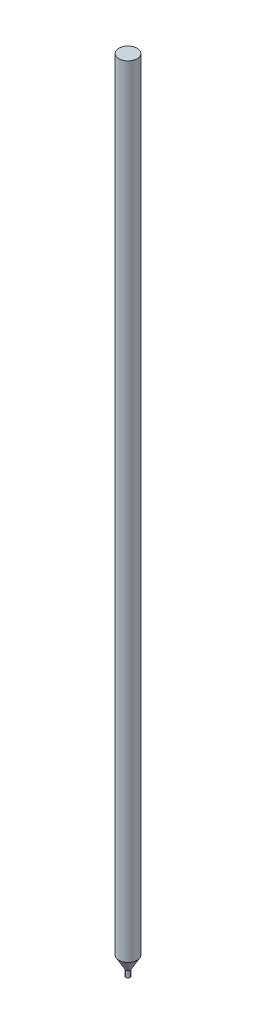
ISO-10303-21;
HEADER;
FILE_DESCRIPTION(('STEP AP214'),'2;1');
FILE_NAME('part.step','',(''),(''),'','','');
FILE_SCHEMA(('AUTOMOTIVE_DESIGN { 1 0 10303 214 1 1 1 1 }'));
ENDSEC;
DATA;
#1=APPLICATION_CONTEXT('core data for automotive mechanical design processes');
#2=APPLICATION_PROTOCOL_DEFINITION('international standard','automotive_design',2000,#1);
#3=PRODUCT_CONTEXT('',#1,'mechanical');
#4=PRODUCT('Part','Part','',(#3));
#5=PRODUCT_RELATED_PRODUCT_CATEGORY('part','',(#4));
#6=PRODUCT_DEFINITION_FORMATION('','',#4);
#7=PRODUCT_DEFINITION_CONTEXT('part definition',#1,'design');
#8=PRODUCT_DEFINITION('design','',#6,#7);
#9=PRODUCT_DEFINITION_SHAPE('','',#8);
#10=(LENGTH_UNIT() NAMED_UNIT(*) SI_UNIT(.MILLI.,.METRE.));
#11=(NAMED_UNIT(*) PLANE_ANGLE_UNIT() SI_UNIT($,.RADIAN.));
#12=(NAMED_UNIT(*) SI_UNIT($,.STERADIAN.) SOLID_ANGLE_UNIT());
#13=UNCERTAINTY_MEASURE_WITH_UNIT(LENGTH_MEASURE(1.E-05),#10,'distance_accuracy_value','');
#14=(GEOMETRIC_REPRESENTATION_CONTEXT(3) GLOBAL_UNCERTAINTY_ASSIGNED_CONTEXT((#13)) GLOBAL_UNIT_ASSIGNED_CONTEXT((#10,
#11,#12)) REPRESENTATION_CONTEXT('',''));
#15=CARTESIAN_POINT('',(0.,0.,0.));
#16=DIRECTION('',(0.,0.,1.));
#17=DIRECTION('',(1.,0.,0.));
#18=AXIS2_PLACEMENT_3D('',#15,#16,#17);
#19=CARTESIAN_POINT('',(0.,75.,0.));
#20=DIRECTION('',(0.,-1.,0.));
#21=DIRECTION('',(0.,0.,-1.));
#22=AXIS2_PLACEMENT_3D('',#19,#20,#21);
#23=CYLINDRICAL_SURFACE('',#22,0.875000000000001);
#24=CARTESIAN_POINT('',(0.,75.,0.));
#25=DIRECTION('',(0.,1.,0.));
#26=DIRECTION('',(0.,0.,1.));
#27=AXIS2_PLACEMENT_3D('',#24,#25,#26);
#28=CIRCLE('',#27,0.875000000000001);
#29=CARTESIAN_POINT('',(0.,75.,0.875000000000001));
#30=VERTEX_POINT('',#29);
#31=EDGE_CURVE('E10',#30,#30,#28,.T.);
#32=ORIENTED_EDGE('',*,*,#31,.F.);
#33=EDGE_LOOP('',(#32));
#34=FACE_BOUND('',#33,.T.);
#35=CARTESIAN_POINT('',(0.,0.,0.));
#36=DIRECTION('',(0.,1.,0.));
#37=DIRECTION('',(0.,0.,1.));
#38=AXIS2_PLACEMENT_3D('',#35,#36,#37);
#39=CIRCLE('',#38,0.875000000000001);
#40=CARTESIAN_POINT('',(0.,0.,0.875000000000001));
#41=VERTEX_POINT('',#40);
#42=EDGE_CURVE('E54',#41,#41,#39,.T.);
#43=ORIENTED_EDGE('',*,*,#42,.T.);
#44=EDGE_LOOP('',(#43));
#45=FACE_BOUND('',#44,.T.);
#46=ADVANCED_FACE('F36',(#34,#45),#23,.T.);
#47=CARTESIAN_POINT('',(0.,75.,0.));
#48=DIRECTION('',(0.,1.,0.));
#49=DIRECTION('',(0.,0.,1.));
#50=AXIS2_PLACEMENT_3D('',#47,#48,#49);
#51=PLANE('',#50);
#52=ORIENTED_EDGE('',*,*,#31,.T.);
#53=EDGE_LOOP('',(#52));
#54=FACE_BOUND('',#53,.T.);
#55=ADVANCED_FACE('F74',(#54),#51,.T.);
#56=CARTESIAN_POINT('',(0.,-1.76913429510898,0.));
#57=DIRECTION('',(0.,1.,0.));
#58=DIRECTION('',(0.,0.,1.));
#59=AXIS2_PLACEMENT_3D('',#56,#57,#58);
#60=PLANE('',#59);
#61=CARTESIAN_POINT('',(0.,-1.76913429510898,0.));
#62=DIRECTION('',(0.,1.,0.));
#63=DIRECTION('',(0.,0.,1.));
#64=AXIS2_PLACEMENT_3D('',#61,#62,#63);
#65=CIRCLE('',#64,0.2);
#66=CARTESIAN_POINT('',(0.,-1.76913429510898,0.2));
#67=VERTEX_POINT('',#66);
#68=EDGE_CURVE('E43',#67,#67,#65,.T.);
#69=ORIENTED_EDGE('',*,*,#68,.F.);
#70=EDGE_LOOP('',(#69));
#71=FACE_BOUND('',#70,.T.);
#72=ADVANCED_FACE('F69',(#71),#60,.F.);
#73=CARTESIAN_POINT('',(0.,0.,0.));
#74=DIRECTION('',(0.,1.,0.));
#75=DIRECTION('',(0.,0.,1.));
#76=AXIS2_PLACEMENT_3D('',#73,#74,#75);
#77=CYLINDRICAL_SURFACE('',#76,0.2);
#78=CARTESIAN_POINT('',(0.,-1.16913429510898,0.));
#79=DIRECTION('',(0.,1.,0.));
#80=DIRECTION('',(0.,0.,1.));
#81=AXIS2_PLACEMENT_3D('',#78,#79,#80);
#82=CIRCLE('',#81,0.2);
#83=CARTESIAN_POINT('',(0.,-1.16913429510898,0.2));
#84=VERTEX_POINT('',#83);
#85=EDGE_CURVE('E49',#84,#84,#82,.T.);
#86=ORIENTED_EDGE('',*,*,#85,.F.);
#87=EDGE_LOOP('',(#86));
#88=FACE_BOUND('',#87,.T.);
#89=ORIENTED_EDGE('',*,*,#68,.T.);
#90=EDGE_LOOP('',(#89));
#91=FACE_BOUND('',#90,.T.);
#92=ADVANCED_FACE('F64',(#88,#91),#77,.T.);
#93=CARTESIAN_POINT('',(0.,-1.16913429510898,0.));
#94=DIRECTION('',(0.,1.,0.));
#95=DIRECTION('',(0.,0.,1.));
#96=AXIS2_PLACEMENT_3D('',#93,#94,#95);
#97=CONICAL_SURFACE('',#96,0.2,0.523598775598304);
#98=ORIENTED_EDGE('',*,*,#42,.F.);
#99=EDGE_LOOP('',(#98));
#100=FACE_BOUND('',#99,.T.);
#101=ORIENTED_EDGE('',*,*,#85,.T.);
#102=EDGE_LOOP('',(#101));
#103=FACE_BOUND('',#102,.T.);
#104=ADVANCED_FACE('F61',(#100,#103),#97,.T.);
#105=CLOSED_SHELL('',(#46,#55,#72,#92,#104));
#106=MANIFOLD_SOLID_BREP('B2',#105);
#107=ADVANCED_BREP_SHAPE_REPRESENTATION('',(#18,#106),#14);
#108=SHAPE_DEFINITION_REPRESENTATION(#9,#107);
ENDSEC;
END-ISO-10303-21;
